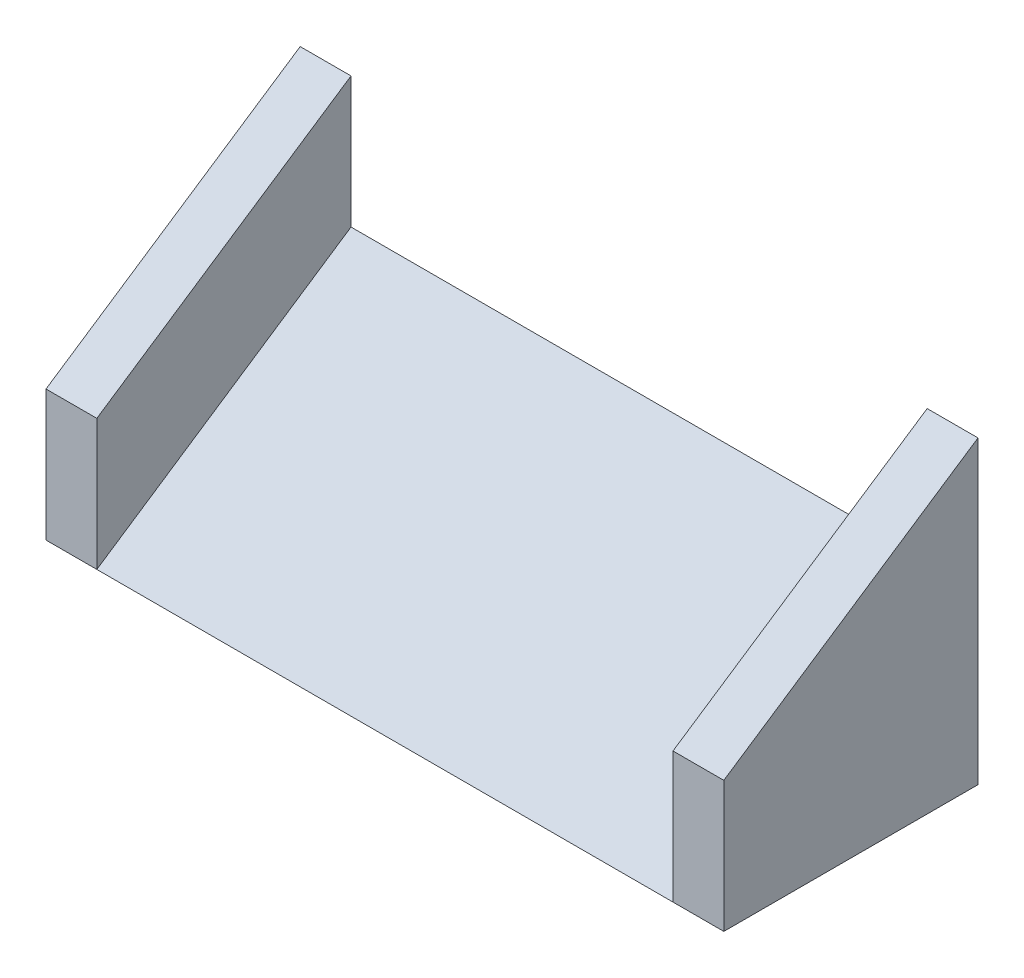
ISO-10303-21;
HEADER;
FILE_DESCRIPTION(('STEP AP214'),'2;1');
FILE_NAME('part.step','',(''),(''),'','','');
FILE_SCHEMA(('AUTOMOTIVE_DESIGN { 1 0 10303 214 1 1 1 1 }'));
ENDSEC;
DATA;
#1=APPLICATION_CONTEXT('core data for automotive mechanical design processes');
#2=APPLICATION_PROTOCOL_DEFINITION('international standard','automotive_design',2000,#1);
#3=PRODUCT_CONTEXT('',#1,'mechanical');
#4=PRODUCT('Part','Part','',(#3));
#5=PRODUCT_RELATED_PRODUCT_CATEGORY('part','',(#4));
#6=PRODUCT_DEFINITION_FORMATION('','',#4);
#7=PRODUCT_DEFINITION_CONTEXT('part definition',#1,'design');
#8=PRODUCT_DEFINITION('design','',#6,#7);
#9=PRODUCT_DEFINITION_SHAPE('','',#8);
#10=(LENGTH_UNIT() NAMED_UNIT(*) SI_UNIT(.MILLI.,.METRE.));
#11=(NAMED_UNIT(*) PLANE_ANGLE_UNIT() SI_UNIT($,.RADIAN.));
#12=(NAMED_UNIT(*) SI_UNIT($,.STERADIAN.) SOLID_ANGLE_UNIT());
#13=UNCERTAINTY_MEASURE_WITH_UNIT(LENGTH_MEASURE(1.E-05),#10,'distance_accuracy_value','');
#14=(GEOMETRIC_REPRESENTATION_CONTEXT(3) GLOBAL_UNCERTAINTY_ASSIGNED_CONTEXT((#13)) GLOBAL_UNIT_ASSIGNED_CONTEXT((#10,
#11,#12)) REPRESENTATION_CONTEXT('',''));
#15=CARTESIAN_POINT('',(0.,0.,0.));
#16=DIRECTION('',(0.,0.,1.));
#17=DIRECTION('',(1.,0.,0.));
#18=AXIS2_PLACEMENT_3D('',#15,#16,#17);
#19=CARTESIAN_POINT('',(17.,5.,-7.5));
#20=DIRECTION('',(0.,-0.832050294337844,-0.554700196225229));
#21=DIRECTION('',(0.,0.554700196225229,-0.832050294337844));
#22=AXIS2_PLACEMENT_3D('',#19,#20,#21);
#23=PLANE('',#22);
#24=DIRECTION('',(0.,-0.554700196225229,0.832050294337844));
#25=VECTOR('',#24,1.);
#26=CARTESIAN_POINT('',(-17.,5.,-7.5));
#27=LINE('',#26,#25);
#28=CARTESIAN_POINT('',(-17.,5.,-7.5));
#29=VERTEX_POINT('',#28);
#30=CARTESIAN_POINT('',(-17.,-5.,7.5));
#31=VERTEX_POINT('',#30);
#32=EDGE_CURVE('E160',#29,#31,#27,.T.);
#33=ORIENTED_EDGE('',*,*,#32,.T.);
#34=DIRECTION('',(-1.,0.,0.));
#35=VECTOR('',#34,1.);
#36=CARTESIAN_POINT('',(17.,-5.,7.5));
#37=LINE('',#36,#35);
#38=CARTESIAN_POINT('',(17.,-5.,7.5));
#39=VERTEX_POINT('',#38);
#40=EDGE_CURVE('E11',#39,#31,#37,.T.);
#41=ORIENTED_EDGE('',*,*,#40,.F.);
#42=DIRECTION('',(0.,-0.554700196225229,0.832050294337844));
#43=VECTOR('',#42,1.);
#44=CARTESIAN_POINT('',(17.,5.,-7.5));
#45=LINE('',#44,#43);
#46=CARTESIAN_POINT('',(17.,5.,-7.5));
#47=VERTEX_POINT('',#46);
#48=EDGE_CURVE('E161',#47,#39,#45,.T.);
#49=ORIENTED_EDGE('',*,*,#48,.F.);
#50=DIRECTION('',(-1.,0.,0.));
#51=VECTOR('',#50,1.);
#52=CARTESIAN_POINT('',(17.,5.,-7.5));
#53=LINE('',#52,#51);
#54=EDGE_CURVE('E51',#47,#29,#53,.T.);
#55=ORIENTED_EDGE('',*,*,#54,.T.);
#56=EDGE_LOOP('',(#33,#41,#49,#55));
#57=FACE_BOUND('',#56,.T.);
#58=ADVANCED_FACE('F37',(#57),#23,.F.);
#59=CARTESIAN_POINT('',(17.,-5.,7.5));
#60=DIRECTION('',(0.,1.,0.));
#61=DIRECTION('',(0.,0.,1.));
#62=AXIS2_PLACEMENT_3D('',#59,#60,#61);
#63=PLANE('',#62);
#64=ORIENTED_EDGE('',*,*,#40,.T.);
#65=DIRECTION('',(1.,0.,0.));
#66=VECTOR('',#65,1.);
#67=CARTESIAN_POINT('',(-20.,-5.,7.5));
#68=LINE('',#67,#66);
#69=CARTESIAN_POINT('',(-20.,-5.,7.5));
#70=VERTEX_POINT('',#69);
#71=EDGE_CURVE('E98',#70,#31,#68,.T.);
#72=ORIENTED_EDGE('',*,*,#71,.F.);
#73=DIRECTION('',(0.,0.,-1.));
#74=VECTOR('',#73,1.);
#75=CARTESIAN_POINT('',(-20.,-5.,7.5));
#76=LINE('',#75,#74);
#77=CARTESIAN_POINT('',(-20.,-5.,-7.5));
#78=VERTEX_POINT('',#77);
#79=EDGE_CURVE('E101',#70,#78,#76,.T.);
#80=ORIENTED_EDGE('',*,*,#79,.T.);
#81=DIRECTION('',(-1.,0.,0.));
#82=VECTOR('',#81,1.);
#83=CARTESIAN_POINT('',(17.,-5.,-7.5));
#84=LINE('',#83,#82);
#85=CARTESIAN_POINT('',(20.,-5.,-7.5));
#86=VERTEX_POINT('',#85);
#87=EDGE_CURVE('E45',#86,#78,#84,.T.);
#88=ORIENTED_EDGE('',*,*,#87,.F.);
#89=DIRECTION('',(0.,0.,-1.));
#90=VECTOR('',#89,1.);
#91=CARTESIAN_POINT('',(20.,-5.,7.5));
#92=LINE('',#91,#90);
#93=CARTESIAN_POINT('',(20.,-5.,7.5));
#94=VERTEX_POINT('',#93);
#95=EDGE_CURVE('E137',#94,#86,#92,.T.);
#96=ORIENTED_EDGE('',*,*,#95,.F.);
#97=DIRECTION('',(-1.,0.,0.));
#98=VECTOR('',#97,1.);
#99=CARTESIAN_POINT('',(20.,-5.,7.5));
#100=LINE('',#99,#98);
#101=EDGE_CURVE('E147',#94,#39,#100,.T.);
#102=ORIENTED_EDGE('',*,*,#101,.T.);
#103=EDGE_LOOP('',(#64,#72,#80,#88,#96,#102));
#104=FACE_BOUND('',#103,.T.);
#105=ADVANCED_FACE('F100',(#104),#63,.F.);
#106=CARTESIAN_POINT('',(17.,-5.,-7.5));
#107=DIRECTION('',(0.,0.,1.));
#108=DIRECTION('',(0.,-1.,0.));
#109=AXIS2_PLACEMENT_3D('',#106,#107,#108);
#110=PLANE('',#109);
#111=ORIENTED_EDGE('',*,*,#87,.T.);
#112=DIRECTION('',(0.,1.,0.));
#113=VECTOR('',#112,1.);
#114=CARTESIAN_POINT('',(-20.,-5.,-7.5));
#115=LINE('',#114,#113);
#116=CARTESIAN_POINT('',(-20.,12.7226172570009,-7.5));
#117=VERTEX_POINT('',#116);
#118=EDGE_CURVE('E118',#78,#117,#115,.T.);
#119=ORIENTED_EDGE('',*,*,#118,.T.);
#120=DIRECTION('',(1.,0.,0.));
#121=VECTOR('',#120,1.);
#122=CARTESIAN_POINT('',(-20.,12.7226172570009,-7.5));
#123=LINE('',#122,#121);
#124=CARTESIAN_POINT('',(-17.,12.7226172570009,-7.5));
#125=VERTEX_POINT('',#124);
#126=EDGE_CURVE('E127',#117,#125,#123,.T.);
#127=ORIENTED_EDGE('',*,*,#126,.T.);
#128=DIRECTION('',(0.,1.,0.));
#129=VECTOR('',#128,1.);
#130=CARTESIAN_POINT('',(-17.,-5.,-7.5));
#131=LINE('',#130,#129);
#132=EDGE_CURVE('E119',#29,#125,#131,.T.);
#133=ORIENTED_EDGE('',*,*,#132,.F.);
#134=ORIENTED_EDGE('',*,*,#54,.F.);
#135=DIRECTION('',(0.,1.,0.));
#136=VECTOR('',#135,1.);
#137=CARTESIAN_POINT('',(17.,-5.,-7.5));
#138=LINE('',#137,#136);
#139=CARTESIAN_POINT('',(17.,12.7226172570009,-7.5));
#140=VERTEX_POINT('',#139);
#141=EDGE_CURVE('E108',#47,#140,#138,.T.);
#142=ORIENTED_EDGE('',*,*,#141,.T.);
#143=DIRECTION('',(-1.,0.,0.));
#144=VECTOR('',#143,1.);
#145=CARTESIAN_POINT('',(20.,12.7226172570009,-7.5));
#146=LINE('',#145,#144);
#147=CARTESIAN_POINT('',(20.,12.7226172570009,-7.5));
#148=VERTEX_POINT('',#147);
#149=EDGE_CURVE('E157',#148,#140,#146,.T.);
#150=ORIENTED_EDGE('',*,*,#149,.F.);
#151=DIRECTION('',(0.,1.,0.));
#152=VECTOR('',#151,1.);
#153=CARTESIAN_POINT('',(20.,-5.,-7.5));
#154=LINE('',#153,#152);
#155=EDGE_CURVE('E140',#86,#148,#154,.T.);
#156=ORIENTED_EDGE('',*,*,#155,.F.);
#157=EDGE_LOOP('',(#111,#119,#127,#133,#134,#142,#150,#156));
#158=FACE_BOUND('',#157,.T.);
#159=ADVANCED_FACE('F166',(#158),#110,.F.);
#160=CARTESIAN_POINT('',(17.,0.,0.));
#161=DIRECTION('',(1.,0.,0.));
#162=DIRECTION('',(0.,0.,-1.));
#163=AXIS2_PLACEMENT_3D('',#160,#161,#162);
#164=PLANE('',#163);
#165=ORIENTED_EDGE('',*,*,#141,.F.);
#166=ORIENTED_EDGE('',*,*,#48,.T.);
#167=DIRECTION('',(0.,-1.,0.));
#168=VECTOR('',#167,1.);
#169=CARTESIAN_POINT('',(17.,-5.,7.5));
#170=LINE('',#169,#168);
#171=CARTESIAN_POINT('',(17.,2.72261725700088,7.5));
#172=VERTEX_POINT('',#171);
#173=EDGE_CURVE('E141',#172,#39,#170,.T.);
#174=ORIENTED_EDGE('',*,*,#173,.F.);
#175=DIRECTION('',(0.,-0.554700196225229,0.832050294337844));
#176=VECTOR('',#175,1.);
#177=CARTESIAN_POINT('',(17.,2.72261725700088,7.5));
#178=LINE('',#177,#176);
#179=EDGE_CURVE('E149',#140,#172,#178,.T.);
#180=ORIENTED_EDGE('',*,*,#179,.F.);
#181=EDGE_LOOP('',(#165,#166,#174,#180));
#182=FACE_BOUND('',#181,.T.);
#183=ADVANCED_FACE('F181',(#182),#164,.F.);
#184=CARTESIAN_POINT('',(20.,2.72261725700088,7.5));
#185=DIRECTION('',(0.,-0.832050294337844,-0.554700196225229));
#186=DIRECTION('',(0.,0.554700196225229,-0.832050294337843));
#187=AXIS2_PLACEMENT_3D('',#184,#185,#186);
#188=PLANE('',#187);
#189=ORIENTED_EDGE('',*,*,#179,.T.);
#190=DIRECTION('',(-1.,0.,0.));
#191=VECTOR('',#190,1.);
#192=CARTESIAN_POINT('',(20.,2.72261725700088,7.5));
#193=LINE('',#192,#191);
#194=CARTESIAN_POINT('',(20.,2.72261725700088,7.5));
#195=VERTEX_POINT('',#194);
#196=EDGE_CURVE('E154',#195,#172,#193,.T.);
#197=ORIENTED_EDGE('',*,*,#196,.F.);
#198=DIRECTION('',(0.,-0.554700196225229,0.832050294337844));
#199=VECTOR('',#198,1.);
#200=CARTESIAN_POINT('',(20.,2.72261725700088,7.5));
#201=LINE('',#200,#199);
#202=EDGE_CURVE('E143',#148,#195,#201,.T.);
#203=ORIENTED_EDGE('',*,*,#202,.F.);
#204=ORIENTED_EDGE('',*,*,#149,.T.);
#205=EDGE_LOOP('',(#189,#197,#203,#204));
#206=FACE_BOUND('',#205,.T.);
#207=ADVANCED_FACE('F206',(#206),#188,.F.);
#208=CARTESIAN_POINT('',(20.,-5.,7.5));
#209=DIRECTION('',(0.,0.,-1.));
#210=DIRECTION('',(-1.,0.,0.));
#211=AXIS2_PLACEMENT_3D('',#208,#209,#210);
#212=PLANE('',#211);
#213=ORIENTED_EDGE('',*,*,#173,.T.);
#214=ORIENTED_EDGE('',*,*,#101,.F.);
#215=DIRECTION('',(0.,-1.,0.));
#216=VECTOR('',#215,1.);
#217=CARTESIAN_POINT('',(20.,-5.,7.5));
#218=LINE('',#217,#216);
#219=EDGE_CURVE('E145',#195,#94,#218,.T.);
#220=ORIENTED_EDGE('',*,*,#219,.F.);
#221=ORIENTED_EDGE('',*,*,#196,.T.);
#222=EDGE_LOOP('',(#213,#214,#220,#221));
#223=FACE_BOUND('',#222,.T.);
#224=ADVANCED_FACE('F176',(#223),#212,.F.);
#225=CARTESIAN_POINT('',(20.,0.,0.));
#226=DIRECTION('',(1.,0.,0.));
#227=DIRECTION('',(0.,0.,-1.));
#228=AXIS2_PLACEMENT_3D('',#225,#226,#227);
#229=PLANE('',#228);
#230=ORIENTED_EDGE('',*,*,#95,.T.);
#231=ORIENTED_EDGE('',*,*,#155,.T.);
#232=ORIENTED_EDGE('',*,*,#202,.T.);
#233=ORIENTED_EDGE('',*,*,#219,.T.);
#234=EDGE_LOOP('',(#230,#231,#232,#233));
#235=FACE_BOUND('',#234,.T.);
#236=ADVANCED_FACE('F171',(#235),#229,.T.);
#237=CARTESIAN_POINT('',(-20.,-5.,7.5));
#238=DIRECTION('',(0.,0.,1.));
#239=DIRECTION('',(1.,0.,0.));
#240=AXIS2_PLACEMENT_3D('',#237,#238,#239);
#241=PLANE('',#240);
#242=DIRECTION('',(0.,-1.,0.));
#243=VECTOR('',#242,1.);
#244=CARTESIAN_POINT('',(-17.,-5.,7.5));
#245=LINE('',#244,#243);
#246=CARTESIAN_POINT('',(-17.,2.72261725700088,7.5));
#247=VERTEX_POINT('',#246);
#248=EDGE_CURVE('E128',#247,#31,#245,.T.);
#249=ORIENTED_EDGE('',*,*,#248,.F.);
#250=DIRECTION('',(1.,0.,0.));
#251=VECTOR('',#250,1.);
#252=CARTESIAN_POINT('',(-20.,2.72261725700088,7.5));
#253=LINE('',#252,#251);
#254=CARTESIAN_POINT('',(-20.,2.72261725700088,7.5));
#255=VERTEX_POINT('',#254);
#256=EDGE_CURVE('E109',#255,#247,#253,.T.);
#257=ORIENTED_EDGE('',*,*,#256,.F.);
#258=DIRECTION('',(0.,-1.,0.));
#259=VECTOR('',#258,1.);
#260=CARTESIAN_POINT('',(-20.,-5.,7.5));
#261=LINE('',#260,#259);
#262=EDGE_CURVE('E115',#255,#70,#261,.T.);
#263=ORIENTED_EDGE('',*,*,#262,.T.);
#264=ORIENTED_EDGE('',*,*,#71,.T.);
#265=EDGE_LOOP('',(#249,#257,#263,#264));
#266=FACE_BOUND('',#265,.T.);
#267=ADVANCED_FACE('F121',(#266),#241,.T.);
#268=CARTESIAN_POINT('',(-20.,2.72261725700088,7.5));
#269=DIRECTION('',(0.,0.832050294337844,0.554700196225229));
#270=DIRECTION('',(0.,-0.554700196225229,0.832050294337843));
#271=AXIS2_PLACEMENT_3D('',#268,#269,#270);
#272=PLANE('',#271);
#273=DIRECTION('',(0.,-0.554700196225229,0.832050294337844));
#274=VECTOR('',#273,1.);
#275=CARTESIAN_POINT('',(-17.,2.72261725700088,7.5));
#276=LINE('',#275,#274);
#277=EDGE_CURVE('E130',#125,#247,#276,.T.);
#278=ORIENTED_EDGE('',*,*,#277,.F.);
#279=ORIENTED_EDGE('',*,*,#126,.F.);
#280=DIRECTION('',(0.,-0.554700196225229,0.832050294337844));
#281=VECTOR('',#280,1.);
#282=CARTESIAN_POINT('',(-20.,2.72261725700088,7.5));
#283=LINE('',#282,#281);
#284=EDGE_CURVE('E122',#117,#255,#283,.T.);
#285=ORIENTED_EDGE('',*,*,#284,.T.);
#286=ORIENTED_EDGE('',*,*,#256,.T.);
#287=EDGE_LOOP('',(#278,#279,#285,#286));
#288=FACE_BOUND('',#287,.T.);
#289=ADVANCED_FACE('F187',(#288),#272,.T.);
#290=CARTESIAN_POINT('',(-20.,0.,0.));
#291=DIRECTION('',(-1.,0.,0.));
#292=DIRECTION('',(0.,0.,-1.));
#293=AXIS2_PLACEMENT_3D('',#290,#291,#292);
#294=PLANE('',#293);
#295=ORIENTED_EDGE('',*,*,#79,.F.);
#296=ORIENTED_EDGE('',*,*,#262,.F.);
#297=ORIENTED_EDGE('',*,*,#284,.F.);
#298=ORIENTED_EDGE('',*,*,#118,.F.);
#299=EDGE_LOOP('',(#295,#296,#297,#298));
#300=FACE_BOUND('',#299,.T.);
#301=ADVANCED_FACE('F113',(#300),#294,.T.);
#302=CARTESIAN_POINT('',(-17.,0.,0.));
#303=DIRECTION('',(-1.,0.,0.));
#304=DIRECTION('',(0.,0.,-1.));
#305=AXIS2_PLACEMENT_3D('',#302,#303,#304);
#306=PLANE('',#305);
#307=ORIENTED_EDGE('',*,*,#32,.F.);
#308=ORIENTED_EDGE('',*,*,#132,.T.);
#309=ORIENTED_EDGE('',*,*,#277,.T.);
#310=ORIENTED_EDGE('',*,*,#248,.T.);
#311=EDGE_LOOP('',(#307,#308,#309,#310));
#312=FACE_BOUND('',#311,.T.);
#313=ADVANCED_FACE('F184',(#312),#306,.F.);
#314=CLOSED_SHELL('',(#58,#105,#159,#183,#207,#224,#236,#267,#289,#301,#313));
#315=MANIFOLD_SOLID_BREP('B2',#314);
#316=ADVANCED_BREP_SHAPE_REPRESENTATION('',(#18,#315),#14);
#317=SHAPE_DEFINITION_REPRESENTATION(#9,#316);
ENDSEC;
END-ISO-10303-21;
